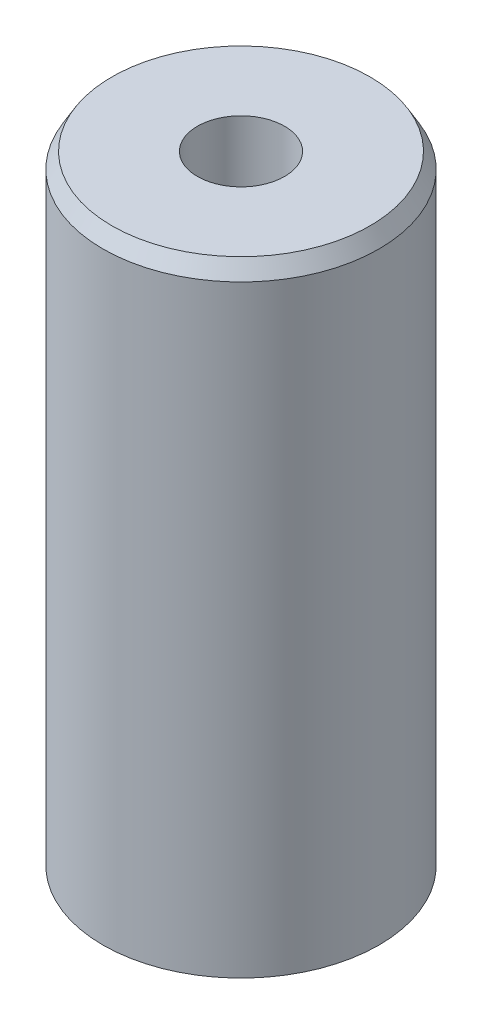
ISO-10303-21;
HEADER;
FILE_DESCRIPTION(('STEP AP214'),'2;1');
FILE_NAME('part.step','',(''),(''),'','','');
FILE_SCHEMA(('AUTOMOTIVE_DESIGN { 1 0 10303 214 1 1 1 1 }'));
ENDSEC;
DATA;
#1=APPLICATION_CONTEXT('core data for automotive mechanical design processes');
#2=APPLICATION_PROTOCOL_DEFINITION('international standard','automotive_design',2000,#1);
#3=PRODUCT_CONTEXT('',#1,'mechanical');
#4=PRODUCT('Part','Part','',(#3));
#5=PRODUCT_RELATED_PRODUCT_CATEGORY('part','',(#4));
#6=PRODUCT_DEFINITION_FORMATION('','',#4);
#7=PRODUCT_DEFINITION_CONTEXT('part definition',#1,'design');
#8=PRODUCT_DEFINITION('design','',#6,#7);
#9=PRODUCT_DEFINITION_SHAPE('','',#8);
#10=(LENGTH_UNIT() NAMED_UNIT(*) SI_UNIT(.MILLI.,.METRE.));
#11=(NAMED_UNIT(*) PLANE_ANGLE_UNIT() SI_UNIT($,.RADIAN.));
#12=(NAMED_UNIT(*) SI_UNIT($,.STERADIAN.) SOLID_ANGLE_UNIT());
#13=UNCERTAINTY_MEASURE_WITH_UNIT(LENGTH_MEASURE(1.E-05),#10,'distance_accuracy_value','');
#14=(GEOMETRIC_REPRESENTATION_CONTEXT(3) GLOBAL_UNCERTAINTY_ASSIGNED_CONTEXT((#13)) GLOBAL_UNIT_ASSIGNED_CONTEXT((#10,
#11,#12)) REPRESENTATION_CONTEXT('',''));
#15=CARTESIAN_POINT('',(0.,0.,0.));
#16=DIRECTION('',(0.,0.,1.));
#17=DIRECTION('',(1.,0.,0.));
#18=AXIS2_PLACEMENT_3D('',#15,#16,#17);
#19=CARTESIAN_POINT('',(0.,56.8151337412872,0.));
#20=DIRECTION('',(0.,-1.,0.));
#21=DIRECTION('',(0.,0.,-1.));
#22=AXIS2_PLACEMENT_3D('',#19,#20,#21);
#23=CYLINDRICAL_SURFACE('',#22,12.5);
#24=CARTESIAN_POINT('',(0.,55.4071581207566,0.));
#25=DIRECTION('',(0.,1.,0.));
#26=DIRECTION('',(0.,0.,1.));
#27=AXIS2_PLACEMENT_3D('',#24,#25,#26);
#28=CIRCLE('',#27,12.5);
#29=CARTESIAN_POINT('',(0.,55.4071581207566,12.5));
#30=VERTEX_POINT('',#29);
#31=EDGE_CURVE('E50',#30,#30,#28,.F.);
#32=ORIENTED_EDGE('',*,*,#31,.T.);
#33=EDGE_LOOP('',(#32));
#34=FACE_BOUND('',#33,.T.);
#35=CARTESIAN_POINT('',(0.,0.812895103525772,0.));
#36=DIRECTION('',(0.,1.,0.));
#37=DIRECTION('',(0.,0.,1.));
#38=AXIS2_PLACEMENT_3D('',#35,#36,#37);
#39=CIRCLE('',#38,12.5);
#40=CARTESIAN_POINT('',(0.,0.812895103525772,12.5));
#41=VERTEX_POINT('',#40);
#42=EDGE_CURVE('E51',#41,#41,#39,.T.);
#43=ORIENTED_EDGE('',*,*,#42,.T.);
#44=EDGE_LOOP('',(#43));
#45=FACE_BOUND('',#44,.T.);
#46=ADVANCED_FACE('F39',(#34,#45),#23,.T.);
#47=CARTESIAN_POINT('',(0.,56.8151337412872,0.));
#48=DIRECTION('',(0.,1.,0.));
#49=DIRECTION('',(0.,0.,1.));
#50=AXIS2_PLACEMENT_3D('',#47,#48,#49);
#51=PLANE('',#50);
#52=CARTESIAN_POINT('',(0.,56.8151337412872,0.));
#53=DIRECTION('',(0.,1.,0.));
#54=DIRECTION('',(0.,0.,1.));
#55=AXIS2_PLACEMENT_3D('',#52,#53,#54);
#56=CIRCLE('',#55,11.6871048964742);
#57=CARTESIAN_POINT('',(0.,56.8151337412872,11.6871048964742));
#58=VERTEX_POINT('',#57);
#59=EDGE_CURVE('E54',#58,#58,#56,.T.);
#60=ORIENTED_EDGE('',*,*,#59,.T.);
#61=EDGE_LOOP('',(#60));
#62=FACE_BOUND('',#61,.T.);
#63=CARTESIAN_POINT('',(0.,56.8151337412872,0.));
#64=DIRECTION('',(0.,1.,0.));
#65=DIRECTION('',(0.,0.,1.));
#66=AXIS2_PLACEMENT_3D('',#63,#64,#65);
#67=CIRCLE('',#66,3.9463070942282);
#68=CARTESIAN_POINT('',(0.,56.8151337412872,3.9463070942282));
#69=VERTEX_POINT('',#68);
#70=EDGE_CURVE('E58',#69,#69,#67,.T.);
#71=ORIENTED_EDGE('',*,*,#70,.F.);
#72=EDGE_LOOP('',(#71));
#73=FACE_BOUND('',#72,.T.);
#74=ADVANCED_FACE('F69',(#62,#73),#51,.T.);
#75=CARTESIAN_POINT('',(0.,0.,0.));
#76=DIRECTION('',(0.,1.,0.));
#77=DIRECTION('',(0.,0.,1.));
#78=AXIS2_PLACEMENT_3D('',#75,#76,#77);
#79=PLANE('',#78);
#80=CARTESIAN_POINT('',(0.,0.,0.));
#81=DIRECTION('',(0.,1.,0.));
#82=DIRECTION('',(0.,0.,1.));
#83=AXIS2_PLACEMENT_3D('',#80,#81,#82);
#84=CIRCLE('',#83,11.0920243794694);
#85=CARTESIAN_POINT('',(0.,0.,11.0920243794694));
#86=VERTEX_POINT('',#85);
#87=EDGE_CURVE('E10',#86,#86,#84,.F.);
#88=ORIENTED_EDGE('',*,*,#87,.T.);
#89=EDGE_LOOP('',(#88));
#90=FACE_BOUND('',#89,.T.);
#91=CARTESIAN_POINT('',(0.,0.,0.));
#92=DIRECTION('',(0.,1.,0.));
#93=DIRECTION('',(0.,0.,1.));
#94=AXIS2_PLACEMENT_3D('',#91,#92,#93);
#95=CIRCLE('',#94,3.9463070942282);
#96=CARTESIAN_POINT('',(0.,0.,3.9463070942282));
#97=VERTEX_POINT('',#96);
#98=EDGE_CURVE('E63',#97,#97,#95,.T.);
#99=ORIENTED_EDGE('',*,*,#98,.T.);
#100=EDGE_LOOP('',(#99));
#101=FACE_BOUND('',#100,.T.);
#102=ADVANCED_FACE('F75',(#90,#101),#79,.F.);
#103=CARTESIAN_POINT('',(0.,56.8151337412872,0.));
#104=DIRECTION('',(0.,-1.,0.));
#105=DIRECTION('',(0.,0.,-1.));
#106=AXIS2_PLACEMENT_3D('',#103,#104,#105);
#107=CYLINDRICAL_SURFACE('',#106,3.9463070942282);
#108=ORIENTED_EDGE('',*,*,#70,.T.);
#109=EDGE_LOOP('',(#108));
#110=FACE_BOUND('',#109,.T.);
#111=ORIENTED_EDGE('',*,*,#98,.F.);
#112=EDGE_LOOP('',(#111));
#113=FACE_BOUND('',#112,.T.);
#114=ADVANCED_FACE('F70',(#110,#113),#107,.F.);
#115=CARTESIAN_POINT('',(0.,56.8151337412872,0.));
#116=DIRECTION('',(0.,-1.,0.));
#117=DIRECTION('',(0.,0.,-1.));
#118=AXIS2_PLACEMENT_3D('',#115,#116,#117);
#119=CONICAL_SURFACE('',#118,11.6871048964742,0.523598775598296);
#120=ORIENTED_EDGE('',*,*,#31,.F.);
#121=EDGE_LOOP('',(#120));
#122=FACE_BOUND('',#121,.T.);
#123=ORIENTED_EDGE('',*,*,#59,.F.);
#124=EDGE_LOOP('',(#123));
#125=FACE_BOUND('',#124,.T.);
#126=ADVANCED_FACE('F81',(#122,#125),#119,.T.);
#127=CARTESIAN_POINT('',(0.,0.812895103525772,0.));
#128=DIRECTION('',(0.,1.,0.));
#129=DIRECTION('',(0.,0.,1.));
#130=AXIS2_PLACEMENT_3D('',#127,#128,#129);
#131=CONICAL_SURFACE('',#130,12.5,1.0471975511966);
#132=ORIENTED_EDGE('',*,*,#87,.F.);
#133=EDGE_LOOP('',(#132));
#134=FACE_BOUND('',#133,.T.);
#135=ORIENTED_EDGE('',*,*,#42,.F.);
#136=EDGE_LOOP('',(#135));
#137=FACE_BOUND('',#136,.T.);
#138=ADVANCED_FACE('F45',(#134,#137),#131,.T.);
#139=CLOSED_SHELL('',(#46,#74,#102,#114,#126,#138));
#140=MANIFOLD_SOLID_BREP('B2',#139);
#141=ADVANCED_BREP_SHAPE_REPRESENTATION('',(#18,#140),#14);
#142=SHAPE_DEFINITION_REPRESENTATION(#9,#141);
ENDSEC;
END-ISO-10303-21;
